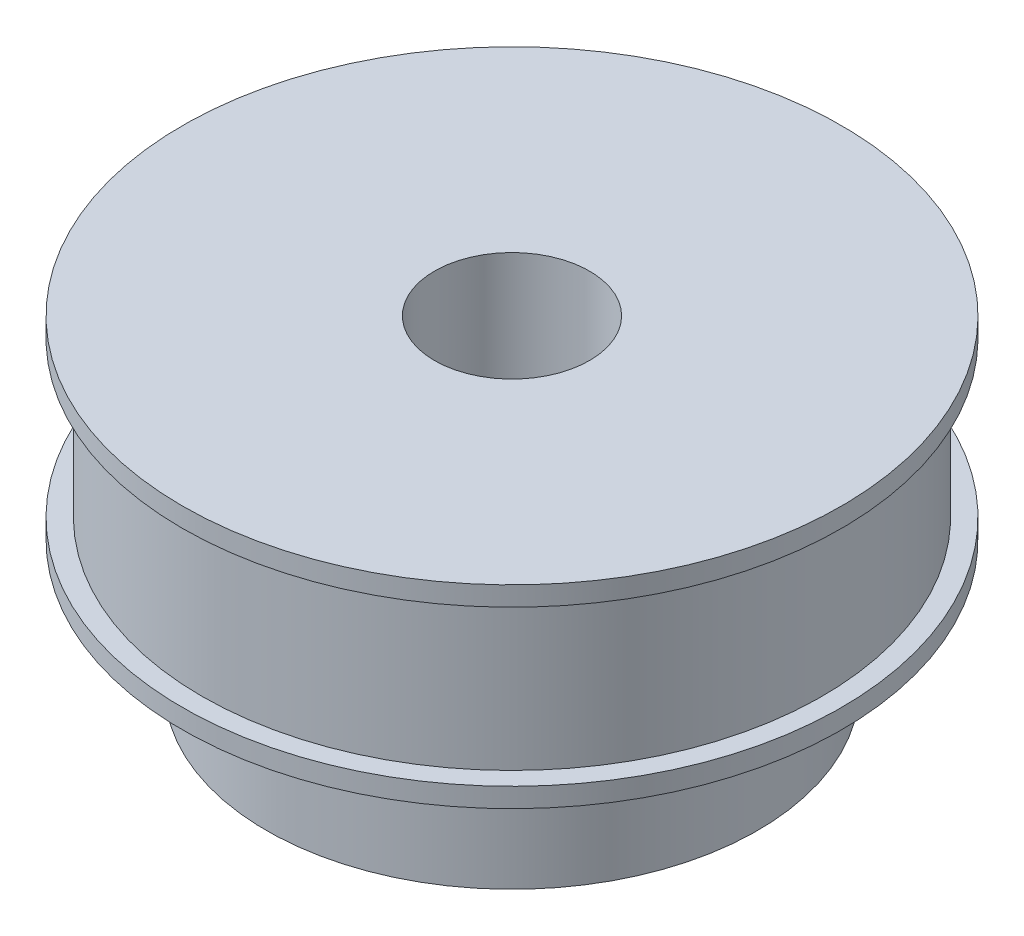
ISO-10303-21;
HEADER;
FILE_DESCRIPTION(('STEP AP214'),'2;1');
FILE_NAME('part.step','',(''),(''),'','','');
FILE_SCHEMA(('AUTOMOTIVE_DESIGN { 1 0 10303 214 1 1 1 1 }'));
ENDSEC;
DATA;
#1=APPLICATION_CONTEXT('core data for automotive mechanical design processes');
#2=APPLICATION_PROTOCOL_DEFINITION('international standard','automotive_design',2000,#1);
#3=PRODUCT_CONTEXT('',#1,'mechanical');
#4=PRODUCT('Part','Part','',(#3));
#5=PRODUCT_RELATED_PRODUCT_CATEGORY('part','',(#4));
#6=PRODUCT_DEFINITION_FORMATION('','',#4);
#7=PRODUCT_DEFINITION_CONTEXT('part definition',#1,'design');
#8=PRODUCT_DEFINITION('design','',#6,#7);
#9=PRODUCT_DEFINITION_SHAPE('','',#8);
#10=(LENGTH_UNIT() NAMED_UNIT(*) SI_UNIT(.MILLI.,.METRE.));
#11=(NAMED_UNIT(*) PLANE_ANGLE_UNIT() SI_UNIT($,.RADIAN.));
#12=(NAMED_UNIT(*) SI_UNIT($,.STERADIAN.) SOLID_ANGLE_UNIT());
#13=UNCERTAINTY_MEASURE_WITH_UNIT(LENGTH_MEASURE(1.E-05),#10,'distance_accuracy_value','');
#14=(GEOMETRIC_REPRESENTATION_CONTEXT(3) GLOBAL_UNCERTAINTY_ASSIGNED_CONTEXT((#13)) GLOBAL_UNIT_ASSIGNED_CONTEXT((#10,
#11,#12)) REPRESENTATION_CONTEXT('',''));
#15=CARTESIAN_POINT('',(0.,0.,0.));
#16=DIRECTION('',(0.,0.,1.));
#17=DIRECTION('',(1.,0.,0.));
#18=AXIS2_PLACEMENT_3D('',#15,#16,#17);
#19=CARTESIAN_POINT('',(0.,12.,0.));
#20=DIRECTION('',(0.,-1.,0.));
#21=DIRECTION('',(0.,0.,-1.));
#22=AXIS2_PLACEMENT_3D('',#19,#20,#21);
#23=CYLINDRICAL_SURFACE('',#22,24.);
#24=CARTESIAN_POINT('',(0.,12.,0.));
#25=DIRECTION('',(0.,1.,0.));
#26=DIRECTION('',(0.,0.,1.));
#27=AXIS2_PLACEMENT_3D('',#24,#25,#26);
#28=CIRCLE('',#27,24.);
#29=CARTESIAN_POINT('',(0.,12.,24.));
#30=VERTEX_POINT('',#29);
#31=EDGE_CURVE('E45',#30,#30,#28,.T.);
#32=ORIENTED_EDGE('',*,*,#31,.F.);
#33=EDGE_LOOP('',(#32));
#34=FACE_BOUND('',#33,.T.);
#35=CARTESIAN_POINT('',(0.,0.,0.));
#36=DIRECTION('',(0.,1.,0.));
#37=DIRECTION('',(0.,0.,1.));
#38=AXIS2_PLACEMENT_3D('',#35,#36,#37);
#39=CIRCLE('',#38,24.);
#40=CARTESIAN_POINT('',(0.,0.,24.));
#41=VERTEX_POINT('',#40);
#42=EDGE_CURVE('E40',#41,#41,#39,.T.);
#43=ORIENTED_EDGE('',*,*,#42,.T.);
#44=EDGE_LOOP('',(#43));
#45=FACE_BOUND('',#44,.T.);
#46=ADVANCED_FACE('F37',(#34,#45),#23,.T.);
#47=CARTESIAN_POINT('',(0.,13.5,0.));
#48=DIRECTION('',(0.,-1.,0.));
#49=DIRECTION('',(0.,0.,-1.));
#50=AXIS2_PLACEMENT_3D('',#47,#48,#49);
#51=CYLINDRICAL_SURFACE('',#50,25.5);
#52=CARTESIAN_POINT('',(0.,13.5,0.));
#53=DIRECTION('',(0.,1.,0.));
#54=DIRECTION('',(0.,0.,1.));
#55=AXIS2_PLACEMENT_3D('',#52,#53,#54);
#56=CIRCLE('',#55,25.5);
#57=CARTESIAN_POINT('',(0.,13.5,25.5));
#58=VERTEX_POINT('',#57);
#59=EDGE_CURVE('E51',#58,#58,#56,.T.);
#60=ORIENTED_EDGE('',*,*,#59,.F.);
#61=EDGE_LOOP('',(#60));
#62=FACE_BOUND('',#61,.T.);
#63=CARTESIAN_POINT('',(0.,12.,0.));
#64=DIRECTION('',(0.,1.,0.));
#65=DIRECTION('',(0.,0.,1.));
#66=AXIS2_PLACEMENT_3D('',#63,#64,#65);
#67=CIRCLE('',#66,25.5);
#68=CARTESIAN_POINT('',(0.,12.,25.5));
#69=VERTEX_POINT('',#68);
#70=EDGE_CURVE('E67',#69,#69,#67,.T.);
#71=ORIENTED_EDGE('',*,*,#70,.T.);
#72=EDGE_LOOP('',(#71));
#73=FACE_BOUND('',#72,.T.);
#74=ADVANCED_FACE('F102',(#62,#73),#51,.T.);
#75=CARTESIAN_POINT('',(0.,13.5,0.));
#76=DIRECTION('',(0.,1.,0.));
#77=DIRECTION('',(0.,0.,1.));
#78=AXIS2_PLACEMENT_3D('',#75,#76,#77);
#79=PLANE('',#78);
#80=CARTESIAN_POINT('',(0.,13.5,0.));
#81=DIRECTION('',(0.,1.,0.));
#82=DIRECTION('',(0.,0.,1.));
#83=AXIS2_PLACEMENT_3D('',#80,#81,#82);
#84=CIRCLE('',#83,6.);
#85=CARTESIAN_POINT('',(0.,13.5,6.));
#86=VERTEX_POINT('',#85);
#87=EDGE_CURVE('E120',#86,#86,#84,.T.);
#88=ORIENTED_EDGE('',*,*,#87,.F.);
#89=EDGE_LOOP('',(#88));
#90=FACE_BOUND('',#89,.T.);
#91=ORIENTED_EDGE('',*,*,#59,.T.);
#92=EDGE_LOOP('',(#91));
#93=FACE_BOUND('',#92,.T.);
#94=ADVANCED_FACE('F96',(#90,#93),#79,.T.);
#95=CARTESIAN_POINT('',(0.,12.,0.));
#96=DIRECTION('',(0.,1.,0.));
#97=DIRECTION('',(0.,0.,1.));
#98=AXIS2_PLACEMENT_3D('',#95,#96,#97);
#99=PLANE('',#98);
#100=ORIENTED_EDGE('',*,*,#31,.T.);
#101=EDGE_LOOP('',(#100));
#102=FACE_BOUND('',#101,.T.);
#103=ORIENTED_EDGE('',*,*,#70,.F.);
#104=EDGE_LOOP('',(#103));
#105=FACE_BOUND('',#104,.T.);
#106=ADVANCED_FACE('F87',(#102,#105),#99,.F.);
#107=CARTESIAN_POINT('',(0.,-1.5,0.));
#108=DIRECTION('',(0.,1.,0.));
#109=DIRECTION('',(0.,0.,1.));
#110=AXIS2_PLACEMENT_3D('',#107,#108,#109);
#111=CYLINDRICAL_SURFACE('',#110,25.5);
#112=CARTESIAN_POINT('',(0.,-1.5,0.));
#113=DIRECTION('',(0.,-1.,0.));
#114=DIRECTION('',(0.,0.,-1.));
#115=AXIS2_PLACEMENT_3D('',#112,#113,#114);
#116=CIRCLE('',#115,25.5);
#117=CARTESIAN_POINT('',(0.,-1.5,-25.5));
#118=VERTEX_POINT('',#117);
#119=EDGE_CURVE('E56',#118,#118,#116,.T.);
#120=ORIENTED_EDGE('',*,*,#119,.F.);
#121=EDGE_LOOP('',(#120));
#122=FACE_BOUND('',#121,.T.);
#123=CARTESIAN_POINT('',(0.,0.,0.));
#124=DIRECTION('',(0.,-1.,0.));
#125=DIRECTION('',(0.,0.,-1.));
#126=AXIS2_PLACEMENT_3D('',#123,#124,#125);
#127=CIRCLE('',#126,25.5);
#128=CARTESIAN_POINT('',(0.,0.,-25.5));
#129=VERTEX_POINT('',#128);
#130=EDGE_CURVE('E60',#129,#129,#127,.T.);
#131=ORIENTED_EDGE('',*,*,#130,.T.);
#132=EDGE_LOOP('',(#131));
#133=FACE_BOUND('',#132,.T.);
#134=ADVANCED_FACE('F85',(#122,#133),#111,.T.);
#135=CARTESIAN_POINT('',(0.,-1.5,0.));
#136=DIRECTION('',(0.,-1.,0.));
#137=DIRECTION('',(0.,0.,-1.));
#138=AXIS2_PLACEMENT_3D('',#135,#136,#137);
#139=PLANE('',#138);
#140=CARTESIAN_POINT('',(0.,-1.5,0.));
#141=DIRECTION('',(0.,-1.,0.));
#142=DIRECTION('',(0.,0.,-1.));
#143=AXIS2_PLACEMENT_3D('',#140,#141,#142);
#144=CIRCLE('',#143,19.);
#145=CARTESIAN_POINT('',(0.,-1.5,-19.));
#146=VERTEX_POINT('',#145);
#147=EDGE_CURVE('E10',#146,#146,#144,.T.);
#148=ORIENTED_EDGE('',*,*,#147,.F.);
#149=EDGE_LOOP('',(#148));
#150=FACE_BOUND('',#149,.T.);
#151=ORIENTED_EDGE('',*,*,#119,.T.);
#152=EDGE_LOOP('',(#151));
#153=FACE_BOUND('',#152,.T.);
#154=ADVANCED_FACE('F81',(#150,#153),#139,.T.);
#155=CARTESIAN_POINT('',(0.,0.,0.));
#156=DIRECTION('',(0.,-1.,0.));
#157=DIRECTION('',(0.,0.,-1.));
#158=AXIS2_PLACEMENT_3D('',#155,#156,#157);
#159=PLANE('',#158);
#160=ORIENTED_EDGE('',*,*,#42,.F.);
#161=EDGE_LOOP('',(#160));
#162=FACE_BOUND('',#161,.T.);
#163=ORIENTED_EDGE('',*,*,#130,.F.);
#164=EDGE_LOOP('',(#163));
#165=FACE_BOUND('',#164,.T.);
#166=ADVANCED_FACE('F77',(#162,#165),#159,.F.);
#167=CARTESIAN_POINT('',(0.,-11.5,0.));
#168=DIRECTION('',(0.,1.,0.));
#169=DIRECTION('',(0.,0.,1.));
#170=AXIS2_PLACEMENT_3D('',#167,#168,#169);
#171=CYLINDRICAL_SURFACE('',#170,19.);
#172=CARTESIAN_POINT('',(0.,-11.5,0.));
#173=DIRECTION('',(0.,-1.,0.));
#174=DIRECTION('',(0.,0.,-1.));
#175=AXIS2_PLACEMENT_3D('',#172,#173,#174);
#176=CIRCLE('',#175,19.);
#177=CARTESIAN_POINT('',(0.,-11.5,-19.));
#178=VERTEX_POINT('',#177);
#179=EDGE_CURVE('E54',#178,#178,#176,.T.);
#180=ORIENTED_EDGE('',*,*,#179,.F.);
#181=EDGE_LOOP('',(#180));
#182=FACE_BOUND('',#181,.T.);
#183=ORIENTED_EDGE('',*,*,#147,.T.);
#184=EDGE_LOOP('',(#183));
#185=FACE_BOUND('',#184,.T.);
#186=ADVANCED_FACE('F80',(#182,#185),#171,.T.);
#187=CARTESIAN_POINT('',(0.,-11.5,0.));
#188=DIRECTION('',(0.,-1.,0.));
#189=DIRECTION('',(0.,0.,-1.));
#190=AXIS2_PLACEMENT_3D('',#187,#188,#189);
#191=PLANE('',#190);
#192=CARTESIAN_POINT('',(0.,-11.5,0.));
#193=DIRECTION('',(0.,-1.,0.));
#194=DIRECTION('',(0.,0.,-1.));
#195=AXIS2_PLACEMENT_3D('',#192,#193,#194);
#196=CIRCLE('',#195,6.);
#197=CARTESIAN_POINT('',(0.,-11.5,-6.));
#198=VERTEX_POINT('',#197);
#199=EDGE_CURVE('E123',#198,#198,#196,.F.);
#200=ORIENTED_EDGE('',*,*,#199,.T.);
#201=EDGE_LOOP('',(#200));
#202=FACE_BOUND('',#201,.T.);
#203=ORIENTED_EDGE('',*,*,#179,.T.);
#204=EDGE_LOOP('',(#203));
#205=FACE_BOUND('',#204,.T.);
#206=ADVANCED_FACE('F133',(#202,#205),#191,.T.);
#207=CARTESIAN_POINT('',(0.,-28.4705627484771,0.));
#208=DIRECTION('',(0.,1.,0.));
#209=DIRECTION('',(0.,0.,1.));
#210=AXIS2_PLACEMENT_3D('',#207,#208,#209);
#211=CYLINDRICAL_SURFACE('',#210,6.);
#212=ORIENTED_EDGE('',*,*,#87,.T.);
#213=EDGE_LOOP('',(#212));
#214=FACE_BOUND('',#213,.T.);
#215=ORIENTED_EDGE('',*,*,#199,.F.);
#216=EDGE_LOOP('',(#215));
#217=FACE_BOUND('',#216,.T.);
#218=ADVANCED_FACE('F140',(#214,#217),#211,.F.);
#219=CLOSED_SHELL('',(#46,#74,#94,#106,#134,#154,#166,#186,#206,#218));
#220=MANIFOLD_SOLID_BREP('B2',#219);
#221=ADVANCED_BREP_SHAPE_REPRESENTATION('',(#18,#220),#14);
#222=SHAPE_DEFINITION_REPRESENTATION(#9,#221);
ENDSEC;
END-ISO-10303-21;
